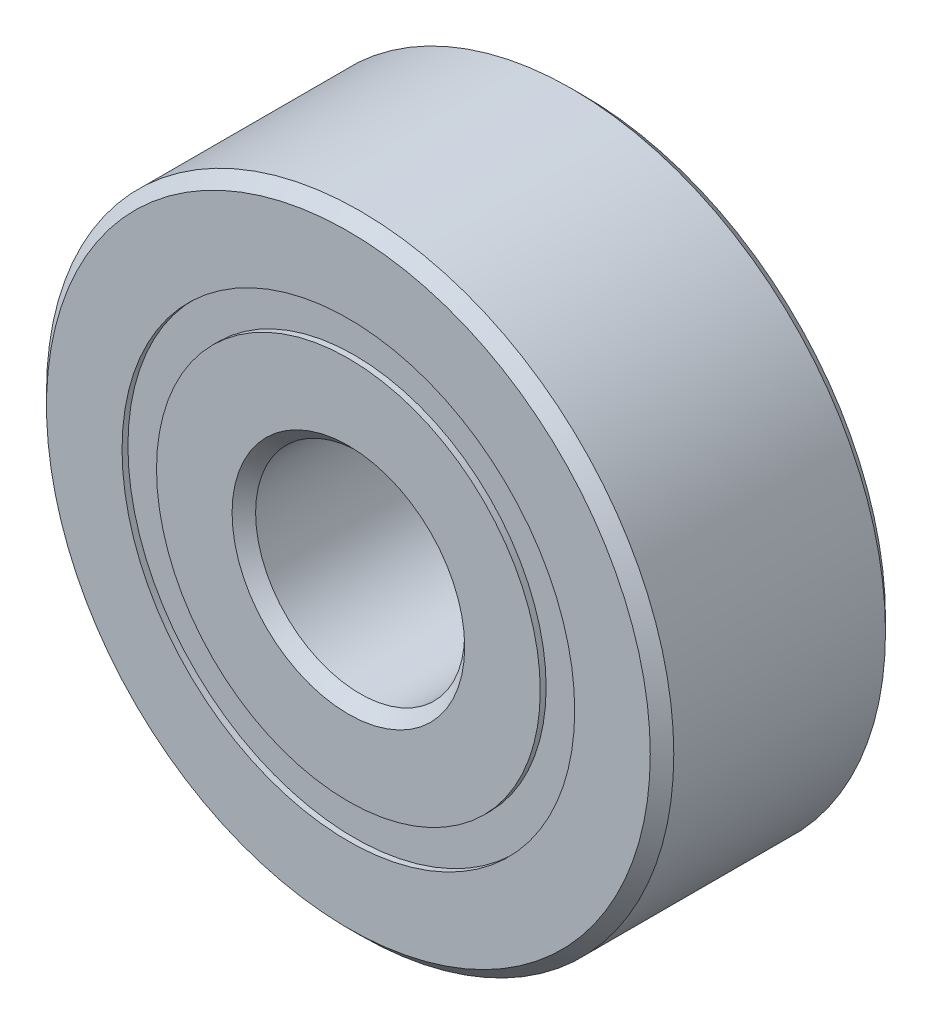
ISO-10303-21;
HEADER;
FILE_DESCRIPTION(('STEP AP214'),'2;1');
FILE_NAME('part.step','',(''),(''),'','','');
FILE_SCHEMA(('AUTOMOTIVE_DESIGN { 1 0 10303 214 1 1 1 1 }'));
ENDSEC;
DATA;
#1=APPLICATION_CONTEXT('core data for automotive mechanical design processes');
#2=APPLICATION_PROTOCOL_DEFINITION('international standard','automotive_design',2000,#1);
#3=PRODUCT_CONTEXT('',#1,'mechanical');
#4=PRODUCT('Part','Part','',(#3));
#5=PRODUCT_RELATED_PRODUCT_CATEGORY('part','',(#4));
#6=PRODUCT_DEFINITION_FORMATION('','',#4);
#7=PRODUCT_DEFINITION_CONTEXT('part definition',#1,'design');
#8=PRODUCT_DEFINITION('design','',#6,#7);
#9=PRODUCT_DEFINITION_SHAPE('','',#8);
#10=(LENGTH_UNIT() NAMED_UNIT(*) SI_UNIT(.MILLI.,.METRE.));
#11=(NAMED_UNIT(*) PLANE_ANGLE_UNIT() SI_UNIT($,.RADIAN.));
#12=(NAMED_UNIT(*) SI_UNIT($,.STERADIAN.) SOLID_ANGLE_UNIT());
#13=UNCERTAINTY_MEASURE_WITH_UNIT(LENGTH_MEASURE(1.E-05),#10,'distance_accuracy_value','');
#14=(GEOMETRIC_REPRESENTATION_CONTEXT(3) GLOBAL_UNCERTAINTY_ASSIGNED_CONTEXT((#13)) GLOBAL_UNIT_ASSIGNED_CONTEXT((#10,
#11,#12)) REPRESENTATION_CONTEXT('',''));
#15=CARTESIAN_POINT('',(0.,0.,0.));
#16=DIRECTION('',(0.,0.,1.));
#17=DIRECTION('',(1.,0.,0.));
#18=AXIS2_PLACEMENT_3D('',#15,#16,#17);
#19=CARTESIAN_POINT('',(0.,6.87335164835165,-3.39328125));
#20=DIRECTION('',(0.,0.,1.));
#21=DIRECTION('',(1.,0.,0.));
#22=AXIS2_PLACEMENT_3D('',#19,#20,#21);
#23=PLANE('',#22);
#24=CARTESIAN_POINT('',(0.,0.,-3.39328125));
#25=DIRECTION('',(0.,0.,1.));
#26=DIRECTION('',(1.,0.,0.));
#27=AXIS2_PLACEMENT_3D('',#24,#25,#26);
#28=CIRCLE('',#27,6.87335164835165);
#29=CARTESIAN_POINT('',(6.87335164835165,0.,-3.39328125));
#30=VERTEX_POINT('',#29);
#31=EDGE_CURVE('E54',#30,#30,#28,.T.);
#32=ORIENTED_EDGE('',*,*,#31,.F.);
#33=EDGE_LOOP('',(#32));
#34=FACE_BOUND('',#33,.T.);
#35=CARTESIAN_POINT('',(0.,0.,-3.39328125));
#36=DIRECTION('',(0.,0.,1.));
#37=DIRECTION('',(1.,0.,0.));
#38=AXIS2_PLACEMENT_3D('',#35,#36,#37);
#39=CIRCLE('',#38,5.82664835164835);
#40=CARTESIAN_POINT('',(5.82664835164835,0.,-3.39328125));
#41=VERTEX_POINT('',#40);
#42=EDGE_CURVE('E11',#41,#41,#39,.T.);
#43=ORIENTED_EDGE('',*,*,#42,.T.);
#44=EDGE_LOOP('',(#43));
#45=FACE_BOUND('',#44,.T.);
#46=ADVANCED_FACE('F40',(#34,#45),#23,.F.);
#47=CARTESIAN_POINT('',(0.,0.,3.571875));
#48=DIRECTION('',(0.,0.,1.));
#49=DIRECTION('',(1.,0.,0.));
#50=AXIS2_PLACEMENT_3D('',#47,#48,#49);
#51=CYLINDRICAL_SURFACE('',#50,5.82664835164835);
#52=ORIENTED_EDGE('',*,*,#42,.F.);
#53=EDGE_LOOP('',(#52));
#54=FACE_BOUND('',#53,.T.);
#55=CARTESIAN_POINT('',(0.,0.,-1.67154216154795));
#56=DIRECTION('',(0.,0.,1.));
#57=DIRECTION('',(1.,0.,0.));
#58=AXIS2_PLACEMENT_3D('',#55,#56,#57);
#59=CIRCLE('',#58,5.82664835164836);
#60=CARTESIAN_POINT('',(5.82664835164836,0.,-1.67154216154795));
#61=VERTEX_POINT('',#60);
#62=EDGE_CURVE('E46',#61,#61,#59,.T.);
#63=ORIENTED_EDGE('',*,*,#62,.T.);
#64=EDGE_LOOP('',(#63));
#65=FACE_BOUND('',#64,.T.);
#66=ADVANCED_FACE('F63',(#54,#65),#51,.F.);
#67=CARTESIAN_POINT('',(0.,6.87335164835165,-1.67154216154795));
#68=DIRECTION('',(0.,0.,-1.));
#69=DIRECTION('',(-1.,0.,0.));
#70=AXIS2_PLACEMENT_3D('',#67,#68,#69);
#71=PLANE('',#70);
#72=ORIENTED_EDGE('',*,*,#62,.F.);
#73=EDGE_LOOP('',(#72));
#74=FACE_BOUND('',#73,.T.);
#75=CARTESIAN_POINT('',(0.,0.,-1.67154216154795));
#76=DIRECTION('',(0.,0.,1.));
#77=DIRECTION('',(1.,0.,0.));
#78=AXIS2_PLACEMENT_3D('',#75,#76,#77);
#79=CIRCLE('',#78,6.87335164835165);
#80=CARTESIAN_POINT('',(6.87335164835165,0.,-1.67154216154795));
#81=VERTEX_POINT('',#80);
#82=EDGE_CURVE('E50',#81,#81,#79,.T.);
#83=ORIENTED_EDGE('',*,*,#82,.T.);
#84=EDGE_LOOP('',(#83));
#85=FACE_BOUND('',#84,.T.);
#86=ADVANCED_FACE('F67',(#74,#85),#71,.F.);
#87=CARTESIAN_POINT('',(0.,0.,3.571875));
#88=DIRECTION('',(0.,0.,1.));
#89=DIRECTION('',(1.,0.,0.));
#90=AXIS2_PLACEMENT_3D('',#87,#88,#89);
#91=CYLINDRICAL_SURFACE('',#90,6.87335164835165);
#92=ORIENTED_EDGE('',*,*,#82,.F.);
#93=EDGE_LOOP('',(#92));
#94=FACE_BOUND('',#93,.T.);
#95=ORIENTED_EDGE('',*,*,#31,.T.);
#96=EDGE_LOOP('',(#95));
#97=FACE_BOUND('',#96,.T.);
#98=ADVANCED_FACE('F60',(#94,#97),#91,.T.);
#99=CLOSED_SHELL('',(#46,#66,#86,#98));
#100=MANIFOLD_SOLID_BREP('B2',#99);
#101=CARTESIAN_POINT('',(0.,6.87335164835165,3.39328125));
#102=DIRECTION('',(0.,0.,-1.));
#103=DIRECTION('',(-1.,0.,0.));
#104=AXIS2_PLACEMENT_3D('',#101,#102,#103);
#105=PLANE('',#104);
#106=CARTESIAN_POINT('',(0.,0.,3.39328125));
#107=DIRECTION('',(0.,0.,1.));
#108=DIRECTION('',(1.,0.,0.));
#109=AXIS2_PLACEMENT_3D('',#106,#107,#108);
#110=CIRCLE('',#109,5.82664835164836);
#111=CARTESIAN_POINT('',(5.82664835164836,0.,3.39328125));
#112=VERTEX_POINT('',#111);
#113=EDGE_CURVE('E39',#112,#112,#110,.T.);
#114=ORIENTED_EDGE('',*,*,#113,.F.);
#115=EDGE_LOOP('',(#114));
#116=FACE_BOUND('',#115,.T.);
#117=CARTESIAN_POINT('',(0.,0.,3.39328125));
#118=DIRECTION('',(0.,0.,1.));
#119=DIRECTION('',(1.,0.,0.));
#120=AXIS2_PLACEMENT_3D('',#117,#118,#119);
#121=CIRCLE('',#120,6.87335164835165);
#122=CARTESIAN_POINT('',(6.87335164835165,0.,3.39328125));
#123=VERTEX_POINT('',#122);
#124=EDGE_CURVE('E122',#123,#123,#121,.T.);
#125=ORIENTED_EDGE('',*,*,#124,.T.);
#126=EDGE_LOOP('',(#125));
#127=FACE_BOUND('',#126,.T.);
#128=ADVANCED_FACE('F108',(#116,#127),#105,.F.);
#129=CARTESIAN_POINT('',(0.,0.,3.571875));
#130=DIRECTION('',(0.,0.,1.));
#131=DIRECTION('',(1.,0.,0.));
#132=AXIS2_PLACEMENT_3D('',#129,#130,#131);
#133=CYLINDRICAL_SURFACE('',#132,5.82664835164836);
#134=CARTESIAN_POINT('',(0.,0.,1.67154216154795));
#135=DIRECTION('',(0.,0.,1.));
#136=DIRECTION('',(1.,0.,0.));
#137=AXIS2_PLACEMENT_3D('',#134,#135,#136);
#138=CIRCLE('',#137,5.82664835164836);
#139=CARTESIAN_POINT('',(5.82664835164836,0.,1.67154216154795));
#140=VERTEX_POINT('',#139);
#141=EDGE_CURVE('E114',#140,#140,#138,.T.);
#142=ORIENTED_EDGE('',*,*,#141,.F.);
#143=EDGE_LOOP('',(#142));
#144=FACE_BOUND('',#143,.T.);
#145=ORIENTED_EDGE('',*,*,#113,.T.);
#146=EDGE_LOOP('',(#145));
#147=FACE_BOUND('',#146,.T.);
#148=ADVANCED_FACE('F137',(#144,#147),#133,.F.);
#149=CARTESIAN_POINT('',(0.,6.87335164835165,1.67154216154795));
#150=DIRECTION('',(0.,0.,1.));
#151=DIRECTION('',(1.,0.,0.));
#152=AXIS2_PLACEMENT_3D('',#149,#150,#151);
#153=PLANE('',#152);
#154=CARTESIAN_POINT('',(0.,0.,1.67154216154795));
#155=DIRECTION('',(0.,0.,1.));
#156=DIRECTION('',(1.,0.,0.));
#157=AXIS2_PLACEMENT_3D('',#154,#155,#156);
#158=CIRCLE('',#157,6.87335164835165);
#159=CARTESIAN_POINT('',(6.87335164835165,0.,1.67154216154795));
#160=VERTEX_POINT('',#159);
#161=EDGE_CURVE('E118',#160,#160,#158,.T.);
#162=ORIENTED_EDGE('',*,*,#161,.F.);
#163=EDGE_LOOP('',(#162));
#164=FACE_BOUND('',#163,.T.);
#165=ORIENTED_EDGE('',*,*,#141,.T.);
#166=EDGE_LOOP('',(#165));
#167=FACE_BOUND('',#166,.T.);
#168=ADVANCED_FACE('F132',(#164,#167),#153,.F.);
#169=CARTESIAN_POINT('',(0.,0.,3.571875));
#170=DIRECTION('',(0.,0.,1.));
#171=DIRECTION('',(1.,0.,0.));
#172=AXIS2_PLACEMENT_3D('',#169,#170,#171);
#173=CYLINDRICAL_SURFACE('',#172,6.87335164835165);
#174=ORIENTED_EDGE('',*,*,#124,.F.);
#175=EDGE_LOOP('',(#174));
#176=FACE_BOUND('',#175,.T.);
#177=ORIENTED_EDGE('',*,*,#161,.T.);
#178=EDGE_LOOP('',(#177));
#179=FACE_BOUND('',#178,.T.);
#180=ADVANCED_FACE('F129',(#176,#179),#173,.T.);
#181=CLOSED_SHELL('',(#128,#148,#168,#180));
#182=MANIFOLD_SOLID_BREP('B6',#181);
#183=CARTESIAN_POINT('',(-3.73243635205714,5.13725791428096,0.));
#184=DIRECTION('',(0.,0.,1.));
#185=DIRECTION('',(-0.587785252292462,0.809016994374955,0.));
#186=AXIS2_PLACEMENT_3D('',#183,#184,#185);
#187=SPHERICAL_SURFACE('',#186,1.67154216154795);
#188=CARTESIAN_POINT('',(-3.73243635205714,5.13725791428096,1.67154216154795));
#189=VERTEX_POINT('',#188);
#190=VERTEX_LOOP('',#189);
#191=FACE_BOUND('',#190,.T.);
#192=ADVANCED_FACE('F175',(#191),#187,.T.);
#193=CLOSED_SHELL('',(#192));
#194=MANIFOLD_SOLID_BREP('B34',#193);
#195=CARTESIAN_POINT('',(-6.0392088784742,1.96225791428098,0.));
#196=DIRECTION('',(0.,0.,1.));
#197=DIRECTION('',(-0.95105651629515,0.309016994374958,0.));
#198=AXIS2_PLACEMENT_3D('',#195,#196,#197);
#199=SPHERICAL_SURFACE('',#198,1.67154216154795);
#200=CARTESIAN_POINT('',(-6.0392088784742,1.96225791428098,1.67154216154795));
#201=VERTEX_POINT('',#200);
#202=VERTEX_LOOP('',#201);
#203=FACE_BOUND('',#202,.T.);
#204=ADVANCED_FACE('F195',(#203),#199,.T.);
#205=CLOSED_SHELL('',(#204));
#206=MANIFOLD_SOLID_BREP('B104',#205);
#207=CARTESIAN_POINT('',(-6.03920887847424,-1.96225791428086,0.));
#208=DIRECTION('',(0.,0.,1.));
#209=DIRECTION('',(-0.951056516295157,-0.309016994374938,0.));
#210=AXIS2_PLACEMENT_3D('',#207,#208,#209);
#211=SPHERICAL_SURFACE('',#210,1.67154216154795);
#212=CARTESIAN_POINT('',(-6.03920887847424,-1.96225791428086,1.67154216154795));
#213=VERTEX_POINT('',#212);
#214=VERTEX_LOOP('',#213);
#215=FACE_BOUND('',#214,.T.);
#216=ADVANCED_FACE('F215',(#215),#211,.T.);
#217=CLOSED_SHELL('',(#216));
#218=MANIFOLD_SOLID_BREP('B171',#217);
#219=CARTESIAN_POINT('',(-3.73243635205725,-5.13725791428088,0.));
#220=DIRECTION('',(0.,0.,1.));
#221=DIRECTION('',(-0.58778525229248,-0.809016994374942,0.));
#222=AXIS2_PLACEMENT_3D('',#219,#220,#221);
#223=SPHERICAL_SURFACE('',#222,1.67154216154795);
#224=CARTESIAN_POINT('',(-3.73243635205725,-5.13725791428088,1.67154216154795));
#225=VERTEX_POINT('',#224);
#226=VERTEX_LOOP('',#225);
#227=FACE_BOUND('',#226,.T.);
#228=ADVANCED_FACE('F235',(#227),#223,.T.);
#229=CLOSED_SHELL('',(#228));
#230=MANIFOLD_SOLID_BREP('B191',#229);
#231=CARTESIAN_POINT('',(0.,-6.35,0.));
#232=DIRECTION('',(0.,0.,1.));
#233=DIRECTION('',(0.,-1.,0.));
#234=AXIS2_PLACEMENT_3D('',#231,#232,#233);
#235=SPHERICAL_SURFACE('',#234,1.67154216154795);
#236=CARTESIAN_POINT('',(0.,-6.35,1.67154216154795));
#237=VERTEX_POINT('',#236);
#238=VERTEX_LOOP('',#237);
#239=FACE_BOUND('',#238,.T.);
#240=ADVANCED_FACE('F255',(#239),#235,.T.);
#241=CLOSED_SHELL('',(#240));
#242=MANIFOLD_SOLID_BREP('B211',#241);
#243=CARTESIAN_POINT('',(3.73243635205718,-5.13725791428094,0.));
#244=DIRECTION('',(0.,0.,1.));
#245=DIRECTION('',(0.587785252292469,-0.809016994374951,0.));
#246=AXIS2_PLACEMENT_3D('',#243,#244,#245);
#247=SPHERICAL_SURFACE('',#246,1.67154216154795);
#248=CARTESIAN_POINT('',(3.73243635205718,-5.13725791428094,1.67154216154795));
#249=VERTEX_POINT('',#248);
#250=VERTEX_LOOP('',#249);
#251=FACE_BOUND('',#250,.T.);
#252=ADVANCED_FACE('F275',(#251),#247,.T.);
#253=CLOSED_SHELL('',(#252));
#254=MANIFOLD_SOLID_BREP('B231',#253);
#255=CARTESIAN_POINT('',(6.03920887847422,-1.96225791428094,0.));
#256=DIRECTION('',(0.,0.,1.));
#257=DIRECTION('',(0.951056516295152,-0.309016994374952,0.));
#258=AXIS2_PLACEMENT_3D('',#255,#256,#257);
#259=SPHERICAL_SURFACE('',#258,1.67154216154795);
#260=CARTESIAN_POINT('',(6.03920887847422,-1.96225791428094,1.67154216154795));
#261=VERTEX_POINT('',#260);
#262=VERTEX_LOOP('',#261);
#263=FACE_BOUND('',#262,.T.);
#264=ADVANCED_FACE('F295',(#263),#259,.T.);
#265=CLOSED_SHELL('',(#264));
#266=MANIFOLD_SOLID_BREP('B251',#265);
#267=CARTESIAN_POINT('',(6.03920887847423,1.9622579142809,0.));
#268=DIRECTION('',(0.,0.,1.));
#269=DIRECTION('',(0.951056516295155,0.309016994374945,0.));
#270=AXIS2_PLACEMENT_3D('',#267,#268,#269);
#271=SPHERICAL_SURFACE('',#270,1.67154216154795);
#272=CARTESIAN_POINT('',(6.03920887847423,1.9622579142809,1.67154216154795));
#273=VERTEX_POINT('',#272);
#274=VERTEX_LOOP('',#273);
#275=FACE_BOUND('',#274,.T.);
#276=ADVANCED_FACE('F315',(#275),#271,.T.);
#277=CLOSED_SHELL('',(#276));
#278=MANIFOLD_SOLID_BREP('B271',#277);
#279=CARTESIAN_POINT('',(3.73243635205721,5.13725791428091,0.));
#280=DIRECTION('',(0.,0.,1.));
#281=DIRECTION('',(0.587785252292474,0.809016994374947,0.));
#282=AXIS2_PLACEMENT_3D('',#279,#280,#281);
#283=SPHERICAL_SURFACE('',#282,1.67154216154795);
#284=CARTESIAN_POINT('',(3.73243635205721,5.13725791428091,1.67154216154795));
#285=VERTEX_POINT('',#284);
#286=VERTEX_LOOP('',#285);
#287=FACE_BOUND('',#286,.T.);
#288=ADVANCED_FACE('F335',(#287),#283,.T.);
#289=CLOSED_SHELL('',(#288));
#290=MANIFOLD_SOLID_BREP('B291',#289);
#291=CARTESIAN_POINT('',(0.,6.35,0.));
#292=DIRECTION('',(0.,0.,1.));
#293=DIRECTION('',(0.,1.,0.));
#294=AXIS2_PLACEMENT_3D('',#291,#292,#293);
#295=SPHERICAL_SURFACE('',#294,1.67154216154795);
#296=CARTESIAN_POINT('',(0.,6.35,1.67154216154795));
#297=VERTEX_POINT('',#296);
#298=VERTEX_LOOP('',#297);
#299=FACE_BOUND('',#298,.T.);
#300=ADVANCED_FACE('F358',(#299),#295,.T.);
#301=CLOSED_SHELL('',(#300));
#302=MANIFOLD_SOLID_BREP('B311',#301);
#303=CARTESIAN_POINT('',(0.,5.82664835164836,3.571875));
#304=DIRECTION('',(0.,0.,-1.));
#305=DIRECTION('',(-1.,0.,0.));
#306=AXIS2_PLACEMENT_3D('',#303,#304,#305);
#307=PLANE('',#306);
#308=CARTESIAN_POINT('',(0.,0.,3.571875));
#309=DIRECTION('',(0.,0.,1.));
#310=DIRECTION('',(1.,0.,0.));
#311=AXIS2_PLACEMENT_3D('',#308,#309,#310);
#312=CIRCLE('',#311,3.5321875);
#313=CARTESIAN_POINT('',(3.5321875,0.,3.571875));
#314=VERTEX_POINT('',#313);
#315=EDGE_CURVE('E406',#314,#314,#312,.T.);
#316=ORIENTED_EDGE('',*,*,#315,.F.);
#317=EDGE_LOOP('',(#316));
#318=FACE_BOUND('',#317,.T.);
#319=CARTESIAN_POINT('',(0.,0.,3.571875));
#320=DIRECTION('',(0.,0.,1.));
#321=DIRECTION('',(1.,0.,0.));
#322=AXIS2_PLACEMENT_3D('',#319,#320,#321);
#323=CIRCLE('',#322,5.82664835164836);
#324=CARTESIAN_POINT('',(5.82664835164836,0.,3.571875));
#325=VERTEX_POINT('',#324);
#326=EDGE_CURVE('E357',#325,#325,#323,.T.);
#327=ORIENTED_EDGE('',*,*,#326,.T.);
#328=EDGE_LOOP('',(#327));
#329=FACE_BOUND('',#328,.T.);
#330=ADVANCED_FACE('F378',(#318,#329),#307,.F.);
#331=CARTESIAN_POINT('',(0.,0.,3.571875));
#332=DIRECTION('',(0.,0.,1.));
#333=DIRECTION('',(1.,0.,0.));
#334=AXIS2_PLACEMENT_3D('',#331,#332,#333);
#335=CYLINDRICAL_SURFACE('',#334,5.82664835164836);
#336=ORIENTED_EDGE('',*,*,#326,.F.);
#337=EDGE_LOOP('',(#336));
#338=FACE_BOUND('',#337,.T.);
#339=CARTESIAN_POINT('',(0.,0.,1.5875));
#340=DIRECTION('',(0.,0.,1.));
#341=DIRECTION('',(1.,0.,0.));
#342=AXIS2_PLACEMENT_3D('',#339,#340,#341);
#343=CIRCLE('',#342,5.82664835164836);
#344=CARTESIAN_POINT('',(5.82664835164836,0.,1.5875));
#345=VERTEX_POINT('',#344);
#346=EDGE_CURVE('E384',#345,#345,#343,.T.);
#347=ORIENTED_EDGE('',*,*,#346,.T.);
#348=EDGE_LOOP('',(#347));
#349=FACE_BOUND('',#348,.T.);
#350=ADVANCED_FACE('F413',(#338,#349),#335,.T.);
#351=CARTESIAN_POINT('',(0.,0.,0.));
#352=DIRECTION('',(0.,0.,1.));
#353=DIRECTION('',(1.,0.,0.));
#354=AXIS2_PLACEMENT_3D('',#351,#352,#353);
#355=TOROIDAL_SURFACE('',#354,6.35,1.67154216154795);
#356=ORIENTED_EDGE('',*,*,#346,.F.);
#357=EDGE_LOOP('',(#356));
#358=FACE_BOUND('',#357,.T.);
#359=CARTESIAN_POINT('',(0.,0.,-1.5875));
#360=DIRECTION('',(0.,0.,1.));
#361=DIRECTION('',(1.,0.,0.));
#362=AXIS2_PLACEMENT_3D('',#359,#360,#361);
#363=CIRCLE('',#362,5.82664835164836);
#364=CARTESIAN_POINT('',(5.82664835164836,0.,-1.5875));
#365=VERTEX_POINT('',#364);
#366=EDGE_CURVE('E388',#365,#365,#363,.T.);
#367=ORIENTED_EDGE('',*,*,#366,.T.);
#368=EDGE_LOOP('',(#367));
#369=FACE_BOUND('',#368,.T.);
#370=ADVANCED_FACE('F417',(#358,#369),#355,.F.);
#371=CARTESIAN_POINT('',(0.,0.,3.571875));
#372=DIRECTION('',(0.,0.,1.));
#373=DIRECTION('',(1.,0.,0.));
#374=AXIS2_PLACEMENT_3D('',#371,#372,#373);
#375=CYLINDRICAL_SURFACE('',#374,5.82664835164836);
#376=ORIENTED_EDGE('',*,*,#366,.F.);
#377=EDGE_LOOP('',(#376));
#378=FACE_BOUND('',#377,.T.);
#379=CARTESIAN_POINT('',(0.,0.,-3.571875));
#380=DIRECTION('',(0.,0.,1.));
#381=DIRECTION('',(1.,0.,0.));
#382=AXIS2_PLACEMENT_3D('',#379,#380,#381);
#383=CIRCLE('',#382,5.82664835164836);
#384=CARTESIAN_POINT('',(5.82664835164836,0.,-3.571875));
#385=VERTEX_POINT('',#384);
#386=EDGE_CURVE('E392',#385,#385,#383,.T.);
#387=ORIENTED_EDGE('',*,*,#386,.T.);
#388=EDGE_LOOP('',(#387));
#389=FACE_BOUND('',#388,.T.);
#390=ADVANCED_FACE('F422',(#378,#389),#375,.T.);
#391=CARTESIAN_POINT('',(0.,3.5321875,-3.571875));
#392=DIRECTION('',(0.,0.,1.));
#393=DIRECTION('',(1.,0.,0.));
#394=AXIS2_PLACEMENT_3D('',#391,#392,#393);
#395=PLANE('',#394);
#396=ORIENTED_EDGE('',*,*,#386,.F.);
#397=EDGE_LOOP('',(#396));
#398=FACE_BOUND('',#397,.T.);
#399=CARTESIAN_POINT('',(0.,0.,-3.571875));
#400=DIRECTION('',(0.,0.,1.));
#401=DIRECTION('',(1.,0.,0.));
#402=AXIS2_PLACEMENT_3D('',#399,#400,#401);
#403=CIRCLE('',#402,3.5321875);
#404=CARTESIAN_POINT('',(3.5321875,0.,-3.571875));
#405=VERTEX_POINT('',#404);
#406=EDGE_CURVE('E397',#405,#405,#403,.T.);
#407=ORIENTED_EDGE('',*,*,#406,.T.);
#408=EDGE_LOOP('',(#407));
#409=FACE_BOUND('',#408,.T.);
#410=ADVANCED_FACE('F428',(#398,#409),#395,.F.);
#411=CARTESIAN_POINT('',(0.,0.,-3.2146875));
#412=DIRECTION('',(0.,0.,-1.));
#413=DIRECTION('',(-1.,0.,0.));
#414=AXIS2_PLACEMENT_3D('',#411,#412,#413);
#415=CONICAL_SURFACE('',#414,3.175,0.78539816339744);
#416=ORIENTED_EDGE('',*,*,#406,.F.);
#417=EDGE_LOOP('',(#416));
#418=FACE_BOUND('',#417,.T.);
#419=CARTESIAN_POINT('',(0.,0.,-3.2146875));
#420=DIRECTION('',(0.,0.,1.));
#421=DIRECTION('',(1.,0.,0.));
#422=AXIS2_PLACEMENT_3D('',#419,#420,#421);
#423=CIRCLE('',#422,3.175);
#424=CARTESIAN_POINT('',(3.175,0.,-3.2146875));
#425=VERTEX_POINT('',#424);
#426=EDGE_CURVE('E400',#425,#425,#423,.T.);
#427=ORIENTED_EDGE('',*,*,#426,.T.);
#428=EDGE_LOOP('',(#427));
#429=FACE_BOUND('',#428,.T.);
#430=ADVANCED_FACE('F432',(#418,#429),#415,.F.);
#431=CARTESIAN_POINT('',(0.,0.,3.571875));
#432=DIRECTION('',(0.,0.,1.));
#433=DIRECTION('',(1.,0.,0.));
#434=AXIS2_PLACEMENT_3D('',#431,#432,#433);
#435=CYLINDRICAL_SURFACE('',#434,3.175);
#436=ORIENTED_EDGE('',*,*,#426,.F.);
#437=EDGE_LOOP('',(#436));
#438=FACE_BOUND('',#437,.T.);
#439=CARTESIAN_POINT('',(0.,0.,3.21468750000001));
#440=DIRECTION('',(0.,0.,1.));
#441=DIRECTION('',(1.,0.,0.));
#442=AXIS2_PLACEMENT_3D('',#439,#440,#441);
#443=CIRCLE('',#442,3.175);
#444=CARTESIAN_POINT('',(3.175,0.,3.21468750000001));
#445=VERTEX_POINT('',#444);
#446=EDGE_CURVE('E403',#445,#445,#443,.T.);
#447=ORIENTED_EDGE('',*,*,#446,.T.);
#448=EDGE_LOOP('',(#447));
#449=FACE_BOUND('',#448,.T.);
#450=ADVANCED_FACE('F436',(#438,#449),#435,.F.);
#451=CARTESIAN_POINT('',(0.,0.,3.571875));
#452=DIRECTION('',(0.,0.,1.));
#453=DIRECTION('',(1.,0.,0.));
#454=AXIS2_PLACEMENT_3D('',#451,#452,#453);
#455=CONICAL_SURFACE('',#454,3.5321875,0.785398163397458);
#456=ORIENTED_EDGE('',*,*,#446,.F.);
#457=EDGE_LOOP('',(#456));
#458=FACE_BOUND('',#457,.T.);
#459=ORIENTED_EDGE('',*,*,#315,.T.);
#460=EDGE_LOOP('',(#459));
#461=FACE_BOUND('',#460,.T.);
#462=ADVANCED_FACE('F410',(#458,#461),#455,.F.);
#463=CLOSED_SHELL('',(#330,#350,#370,#390,#410,#430,#450,#462));
#464=MANIFOLD_SOLID_BREP('B331',#463);
#465=CARTESIAN_POINT('',(0.,0.,3.2146875));
#466=DIRECTION('',(0.,0.,-1.));
#467=DIRECTION('',(-1.,0.,0.));
#468=AXIS2_PLACEMENT_3D('',#465,#466,#467);
#469=CONICAL_SURFACE('',#468,9.525,0.785398163397446);
#470=CARTESIAN_POINT('',(0.,0.,3.571875));
#471=DIRECTION('',(0.,0.,1.));
#472=DIRECTION('',(1.,0.,0.));
#473=AXIS2_PLACEMENT_3D('',#470,#471,#472);
#474=CIRCLE('',#473,9.1678125);
#475=CARTESIAN_POINT('',(9.1678125,0.,3.571875));
#476=VERTEX_POINT('',#475);
#477=EDGE_CURVE('E528',#476,#476,#474,.T.);
#478=ORIENTED_EDGE('',*,*,#477,.F.);
#479=EDGE_LOOP('',(#478));
#480=FACE_BOUND('',#479,.T.);
#481=CARTESIAN_POINT('',(0.,0.,3.2146875));
#482=DIRECTION('',(0.,0.,1.));
#483=DIRECTION('',(1.,0.,0.));
#484=AXIS2_PLACEMENT_3D('',#481,#482,#483);
#485=CIRCLE('',#484,9.525);
#486=CARTESIAN_POINT('',(9.525,0.,3.2146875));
#487=VERTEX_POINT('',#486);
#488=EDGE_CURVE('E377',#487,#487,#485,.T.);
#489=ORIENTED_EDGE('',*,*,#488,.T.);
#490=EDGE_LOOP('',(#489));
#491=FACE_BOUND('',#490,.T.);
#492=ADVANCED_FACE('F500',(#480,#491),#469,.T.);
#493=CARTESIAN_POINT('',(0.,0.,3.571875));
#494=DIRECTION('',(0.,0.,1.));
#495=DIRECTION('',(1.,0.,0.));
#496=AXIS2_PLACEMENT_3D('',#493,#494,#495);
#497=CYLINDRICAL_SURFACE('',#496,9.525);
#498=ORIENTED_EDGE('',*,*,#488,.F.);
#499=EDGE_LOOP('',(#498));
#500=FACE_BOUND('',#499,.T.);
#501=CARTESIAN_POINT('',(0.,0.,-3.2146875));
#502=DIRECTION('',(0.,0.,1.));
#503=DIRECTION('',(1.,0.,0.));
#504=AXIS2_PLACEMENT_3D('',#501,#502,#503);
#505=CIRCLE('',#504,9.525);
#506=CARTESIAN_POINT('',(9.525,0.,-3.2146875));
#507=VERTEX_POINT('',#506);
#508=EDGE_CURVE('E506',#507,#507,#505,.T.);
#509=ORIENTED_EDGE('',*,*,#508,.T.);
#510=EDGE_LOOP('',(#509));
#511=FACE_BOUND('',#510,.T.);
#512=ADVANCED_FACE('F535',(#500,#511),#497,.T.);
#513=CARTESIAN_POINT('',(0.,0.,-3.571875));
#514=DIRECTION('',(0.,0.,1.));
#515=DIRECTION('',(1.,0.,0.));
#516=AXIS2_PLACEMENT_3D('',#513,#514,#515);
#517=CONICAL_SURFACE('',#516,9.1678125,0.785398163397441);
#518=ORIENTED_EDGE('',*,*,#508,.F.);
#519=EDGE_LOOP('',(#518));
#520=FACE_BOUND('',#519,.T.);
#521=CARTESIAN_POINT('',(0.,0.,-3.571875));
#522=DIRECTION('',(0.,0.,1.));
#523=DIRECTION('',(1.,0.,0.));
#524=AXIS2_PLACEMENT_3D('',#521,#522,#523);
#525=CIRCLE('',#524,9.1678125);
#526=CARTESIAN_POINT('',(9.1678125,0.,-3.571875));
#527=VERTEX_POINT('',#526);
#528=EDGE_CURVE('E510',#527,#527,#525,.T.);
#529=ORIENTED_EDGE('',*,*,#528,.T.);
#530=EDGE_LOOP('',(#529));
#531=FACE_BOUND('',#530,.T.);
#532=ADVANCED_FACE('F539',(#520,#531),#517,.T.);
#533=CARTESIAN_POINT('',(0.,9.1678125,-3.571875));
#534=DIRECTION('',(0.,0.,1.));
#535=DIRECTION('',(1.,0.,0.));
#536=AXIS2_PLACEMENT_3D('',#533,#534,#535);
#537=PLANE('',#536);
#538=ORIENTED_EDGE('',*,*,#528,.F.);
#539=EDGE_LOOP('',(#538));
#540=FACE_BOUND('',#539,.T.);
#541=CARTESIAN_POINT('',(0.,0.,-3.571875));
#542=DIRECTION('',(0.,0.,1.));
#543=DIRECTION('',(1.,0.,0.));
#544=AXIS2_PLACEMENT_3D('',#541,#542,#543);
#545=CIRCLE('',#544,6.87335164835165);
#546=CARTESIAN_POINT('',(6.87335164835165,0.,-3.571875));
#547=VERTEX_POINT('',#546);
#548=EDGE_CURVE('E514',#547,#547,#545,.T.);
#549=ORIENTED_EDGE('',*,*,#548,.T.);
#550=EDGE_LOOP('',(#549));
#551=FACE_BOUND('',#550,.T.);
#552=ADVANCED_FACE('F544',(#540,#551),#537,.F.);
#553=CARTESIAN_POINT('',(0.,0.,3.571875));
#554=DIRECTION('',(0.,0.,1.));
#555=DIRECTION('',(1.,0.,0.));
#556=AXIS2_PLACEMENT_3D('',#553,#554,#555);
#557=CYLINDRICAL_SURFACE('',#556,6.87335164835165);
#558=ORIENTED_EDGE('',*,*,#548,.F.);
#559=EDGE_LOOP('',(#558));
#560=FACE_BOUND('',#559,.T.);
#561=CARTESIAN_POINT('',(0.,0.,-1.5875));
#562=DIRECTION('',(0.,0.,1.));
#563=DIRECTION('',(1.,0.,0.));
#564=AXIS2_PLACEMENT_3D('',#561,#562,#563);
#565=CIRCLE('',#564,6.87335164835165);
#566=CARTESIAN_POINT('',(6.87335164835165,0.,-1.5875));
#567=VERTEX_POINT('',#566);
#568=EDGE_CURVE('E519',#567,#567,#565,.T.);
#569=ORIENTED_EDGE('',*,*,#568,.T.);
#570=EDGE_LOOP('',(#569));
#571=FACE_BOUND('',#570,.T.);
#572=ADVANCED_FACE('F550',(#560,#571),#557,.F.);
#573=CARTESIAN_POINT('',(0.,0.,0.));
#574=DIRECTION('',(0.,0.,1.));
#575=DIRECTION('',(1.,0.,0.));
#576=AXIS2_PLACEMENT_3D('',#573,#574,#575);
#577=TOROIDAL_SURFACE('',#576,6.35,1.67154216154795);
#578=ORIENTED_EDGE('',*,*,#568,.F.);
#579=EDGE_LOOP('',(#578));
#580=FACE_BOUND('',#579,.T.);
#581=CARTESIAN_POINT('',(0.,0.,1.5875));
#582=DIRECTION('',(0.,0.,1.));
#583=DIRECTION('',(1.,0.,0.));
#584=AXIS2_PLACEMENT_3D('',#581,#582,#583);
#585=CIRCLE('',#584,6.87335164835165);
#586=CARTESIAN_POINT('',(6.87335164835165,0.,1.5875));
#587=VERTEX_POINT('',#586);
#588=EDGE_CURVE('E522',#587,#587,#585,.T.);
#589=ORIENTED_EDGE('',*,*,#588,.T.);
#590=EDGE_LOOP('',(#589));
#591=FACE_BOUND('',#590,.T.);
#592=ADVANCED_FACE('F554',(#580,#591),#577,.F.);
#593=CARTESIAN_POINT('',(0.,0.,3.571875));
#594=DIRECTION('',(0.,0.,1.));
#595=DIRECTION('',(1.,0.,0.));
#596=AXIS2_PLACEMENT_3D('',#593,#594,#595);
#597=CYLINDRICAL_SURFACE('',#596,6.87335164835165);
#598=ORIENTED_EDGE('',*,*,#588,.F.);
#599=EDGE_LOOP('',(#598));
#600=FACE_BOUND('',#599,.T.);
#601=CARTESIAN_POINT('',(0.,0.,3.571875));
#602=DIRECTION('',(0.,0.,1.));
#603=DIRECTION('',(1.,0.,0.));
#604=AXIS2_PLACEMENT_3D('',#601,#602,#603);
#605=CIRCLE('',#604,6.87335164835165);
#606=CARTESIAN_POINT('',(6.87335164835165,0.,3.571875));
#607=VERTEX_POINT('',#606);
#608=EDGE_CURVE('E525',#607,#607,#605,.T.);
#609=ORIENTED_EDGE('',*,*,#608,.T.);
#610=EDGE_LOOP('',(#609));
#611=FACE_BOUND('',#610,.T.);
#612=ADVANCED_FACE('F558',(#600,#611),#597,.F.);
#613=CARTESIAN_POINT('',(0.,9.1678125,3.571875));
#614=DIRECTION('',(0.,0.,-1.));
#615=DIRECTION('',(-1.,0.,0.));
#616=AXIS2_PLACEMENT_3D('',#613,#614,#615);
#617=PLANE('',#616);
#618=ORIENTED_EDGE('',*,*,#608,.F.);
#619=EDGE_LOOP('',(#618));
#620=FACE_BOUND('',#619,.T.);
#621=ORIENTED_EDGE('',*,*,#477,.T.);
#622=EDGE_LOOP('',(#621));
#623=FACE_BOUND('',#622,.T.);
#624=ADVANCED_FACE('F532',(#620,#623),#617,.F.);
#625=CLOSED_SHELL('',(#492,#512,#532,#552,#572,#592,#612,#624));
#626=MANIFOLD_SOLID_BREP('B352',#625);
#627=ADVANCED_BREP_SHAPE_REPRESENTATION('',(#18,#100,#182,#194,#206,#218,#230,#242,#254,#266,
#278,#290,#302,#464,#626),#14);
#628=SHAPE_DEFINITION_REPRESENTATION(#9,#627);
ENDSEC;
END-ISO-10303-21;
